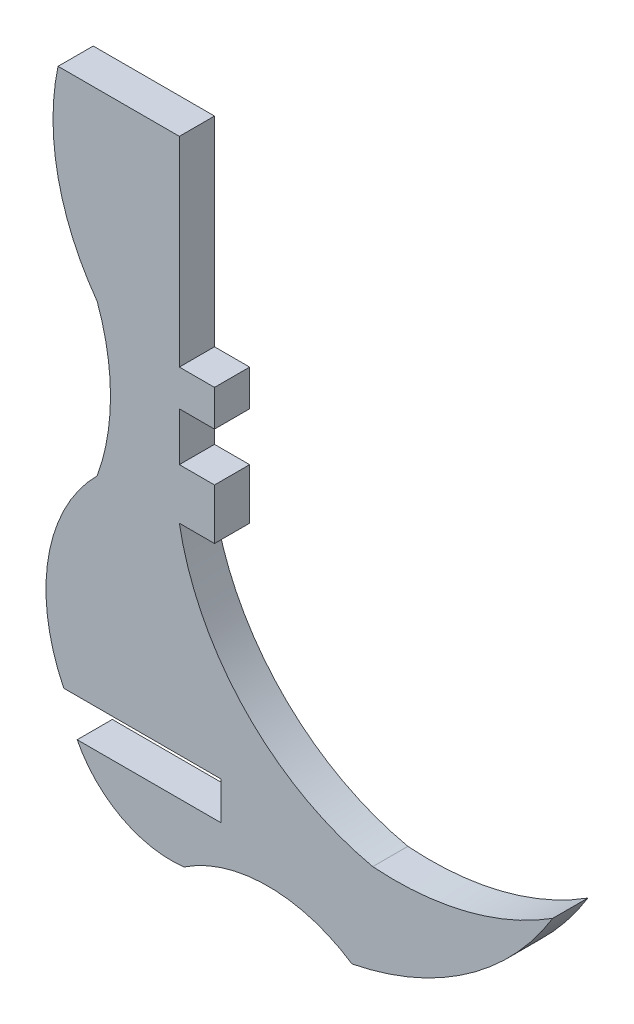
ISO-10303-21;
HEADER;
FILE_DESCRIPTION(('STEP AP214'),'2;1');
FILE_NAME('part.step','',(''),(''),'','','');
FILE_SCHEMA(('AUTOMOTIVE_DESIGN { 1 0 10303 214 1 1 1 1 }'));
ENDSEC;
DATA;
#1=APPLICATION_CONTEXT('core data for automotive mechanical design processes');
#2=APPLICATION_PROTOCOL_DEFINITION('international standard','automotive_design',2000,#1);
#3=PRODUCT_CONTEXT('',#1,'mechanical');
#4=PRODUCT('Part','Part','',(#3));
#5=PRODUCT_RELATED_PRODUCT_CATEGORY('part','',(#4));
#6=PRODUCT_DEFINITION_FORMATION('','',#4);
#7=PRODUCT_DEFINITION_CONTEXT('part definition',#1,'design');
#8=PRODUCT_DEFINITION('design','',#6,#7);
#9=PRODUCT_DEFINITION_SHAPE('','',#8);
#10=(LENGTH_UNIT() NAMED_UNIT(*) SI_UNIT(.MILLI.,.METRE.));
#11=(NAMED_UNIT(*) PLANE_ANGLE_UNIT() SI_UNIT($,.RADIAN.));
#12=(NAMED_UNIT(*) SI_UNIT($,.STERADIAN.) SOLID_ANGLE_UNIT());
#13=UNCERTAINTY_MEASURE_WITH_UNIT(LENGTH_MEASURE(1.E-05),#10,'distance_accuracy_value','');
#14=(GEOMETRIC_REPRESENTATION_CONTEXT(3) GLOBAL_UNCERTAINTY_ASSIGNED_CONTEXT((#13)) GLOBAL_UNIT_ASSIGNED_CONTEXT((#10,
#11,#12)) REPRESENTATION_CONTEXT('',''));
#15=CARTESIAN_POINT('',(0.,0.,0.));
#16=DIRECTION('',(0.,0.,1.));
#17=DIRECTION('',(1.,0.,0.));
#18=AXIS2_PLACEMENT_3D('',#15,#16,#17);
#19=CARTESIAN_POINT('',(0.,-1.96432755596697,1.524));
#20=DIRECTION('',(-1.,0.,0.));
#21=DIRECTION('',(0.,-1.,0.));
#22=AXIS2_PLACEMENT_3D('',#19,#20,#21);
#23=PLANE('',#22);
#24=DIRECTION('',(0.,1.,0.));
#25=VECTOR('',#24,1.);
#26=CARTESIAN_POINT('',(0.,-1.96432755596697,0.));
#27=LINE('',#26,#25);
#28=CARTESIAN_POINT('',(0.,-4.16334006774832,0.));
#29=VERTEX_POINT('',#28);
#30=CARTESIAN_POINT('',(0.,-1.96432755596697,0.));
#31=VERTEX_POINT('',#30);
#32=EDGE_CURVE('E199',#29,#31,#27,.T.);
#33=ORIENTED_EDGE('',*,*,#32,.T.);
#34=DIRECTION('',(0.,0.,-1.));
#35=VECTOR('',#34,1.);
#36=CARTESIAN_POINT('',(0.,-1.96432755596697,1.524));
#37=LINE('',#36,#35);
#38=CARTESIAN_POINT('',(0.,-1.96432755596697,1.524));
#39=VERTEX_POINT('',#38);
#40=EDGE_CURVE('E11',#39,#31,#37,.T.);
#41=ORIENTED_EDGE('',*,*,#40,.F.);
#42=DIRECTION('',(0.,1.,0.));
#43=VECTOR('',#42,1.);
#44=CARTESIAN_POINT('',(0.,-1.96432755596697,1.524));
#45=LINE('',#44,#43);
#46=CARTESIAN_POINT('',(0.,-4.16334006774832,1.524));
#47=VERTEX_POINT('',#46);
#48=EDGE_CURVE('E238',#47,#39,#45,.T.);
#49=ORIENTED_EDGE('',*,*,#48,.F.);
#50=DIRECTION('',(0.,0.,-1.));
#51=VECTOR('',#50,1.);
#52=CARTESIAN_POINT('',(0.,-4.16334006774832,1.524));
#53=LINE('',#52,#51);
#54=EDGE_CURVE('E195',#47,#29,#53,.T.);
#55=ORIENTED_EDGE('',*,*,#54,.T.);
#56=EDGE_LOOP('',(#33,#41,#49,#55));
#57=FACE_BOUND('',#56,.T.);
#58=ADVANCED_FACE('F31',(#57),#23,.F.);
#59=CARTESIAN_POINT('',(0.,-1.96432755596697,1.524));
#60=DIRECTION('',(0.,-1.,0.));
#61=DIRECTION('',(0.,0.,-1.));
#62=AXIS2_PLACEMENT_3D('',#59,#60,#61);
#63=PLANE('',#62);
#64=DIRECTION('',(-1.,0.,0.));
#65=VECTOR('',#64,1.);
#66=CARTESIAN_POINT('',(0.,-1.96432755596697,0.));
#67=LINE('',#66,#65);
#68=CARTESIAN_POINT('',(-1.524,-1.96432755596697,0.));
#69=VERTEX_POINT('',#68);
#70=EDGE_CURVE('E202',#31,#69,#67,.T.);
#71=ORIENTED_EDGE('',*,*,#70,.T.);
#72=DIRECTION('',(0.,0.,-1.));
#73=VECTOR('',#72,1.);
#74=CARTESIAN_POINT('',(-1.524,-1.96432755596697,1.524));
#75=LINE('',#74,#73);
#76=CARTESIAN_POINT('',(-1.524,-1.96432755596697,1.524));
#77=VERTEX_POINT('',#76);
#78=EDGE_CURVE('E39',#77,#69,#75,.T.);
#79=ORIENTED_EDGE('',*,*,#78,.F.);
#80=DIRECTION('',(-1.,0.,0.));
#81=VECTOR('',#80,1.);
#82=CARTESIAN_POINT('',(0.,-1.96432755596697,1.524));
#83=LINE('',#82,#81);
#84=EDGE_CURVE('E126',#39,#77,#83,.T.);
#85=ORIENTED_EDGE('',*,*,#84,.F.);
#86=ORIENTED_EDGE('',*,*,#40,.T.);
#87=EDGE_LOOP('',(#71,#79,#85,#86));
#88=FACE_BOUND('',#87,.T.);
#89=ADVANCED_FACE('F356',(#88),#63,.F.);
#90=CARTESIAN_POINT('',(-1.524,-1.96432755596697,1.524));
#91=DIRECTION('',(-1.,0.,0.));
#92=DIRECTION('',(0.,0.,1.));
#93=AXIS2_PLACEMENT_3D('',#90,#91,#92);
#94=PLANE('',#93);
#95=DIRECTION('',(0.,1.,0.));
#96=VECTOR('',#95,1.);
#97=CARTESIAN_POINT('',(-1.524,-1.96432755596697,0.));
#98=LINE('',#97,#96);
#99=CARTESIAN_POINT('',(-1.524,0.132092651268706,0.));
#100=VERTEX_POINT('',#99);
#101=EDGE_CURVE('E204',#69,#100,#98,.T.);
#102=ORIENTED_EDGE('',*,*,#101,.T.);
#103=DIRECTION('',(0.,0.,-1.));
#104=VECTOR('',#103,1.);
#105=CARTESIAN_POINT('',(-1.524,0.132092651268706,1.524));
#106=LINE('',#105,#104);
#107=CARTESIAN_POINT('',(-1.524,0.132092651268706,1.524));
#108=VERTEX_POINT('',#107);
#109=EDGE_CURVE('E281',#108,#100,#106,.T.);
#110=ORIENTED_EDGE('',*,*,#109,.F.);
#111=DIRECTION('',(0.,1.,0.));
#112=VECTOR('',#111,1.);
#113=CARTESIAN_POINT('',(-1.524,-1.96432755596697,1.524));
#114=LINE('',#113,#112);
#115=EDGE_CURVE('E289',#77,#108,#114,.T.);
#116=ORIENTED_EDGE('',*,*,#115,.F.);
#117=ORIENTED_EDGE('',*,*,#78,.T.);
#118=EDGE_LOOP('',(#102,#110,#116,#117));
#119=FACE_BOUND('',#118,.T.);
#120=ADVANCED_FACE('F287',(#119),#94,.F.);
#121=CARTESIAN_POINT('',(-1.524,0.132092651268706,1.524));
#122=DIRECTION('',(0.,1.,0.));
#123=DIRECTION('',(-1.,0.,0.));
#124=AXIS2_PLACEMENT_3D('',#121,#122,#123);
#125=PLANE('',#124);
#126=DIRECTION('',(1.,0.,0.));
#127=VECTOR('',#126,1.);
#128=CARTESIAN_POINT('',(-1.524,0.132092651268706,0.));
#129=LINE('',#128,#127);
#130=CARTESIAN_POINT('',(0.,0.13209265126871,0.));
#131=VERTEX_POINT('',#130);
#132=EDGE_CURVE('E206',#100,#131,#129,.T.);
#133=ORIENTED_EDGE('',*,*,#132,.T.);
#134=DIRECTION('',(0.,0.,-1.));
#135=VECTOR('',#134,1.);
#136=CARTESIAN_POINT('',(0.,0.13209265126871,1.524));
#137=LINE('',#136,#135);
#138=CARTESIAN_POINT('',(0.,0.13209265126871,1.524));
#139=VERTEX_POINT('',#138);
#140=EDGE_CURVE('E278',#139,#131,#137,.T.);
#141=ORIENTED_EDGE('',*,*,#140,.F.);
#142=DIRECTION('',(1.,0.,0.));
#143=VECTOR('',#142,1.);
#144=CARTESIAN_POINT('',(-1.524,0.132092651268706,1.524));
#145=LINE('',#144,#143);
#146=EDGE_CURVE('E307',#108,#139,#145,.T.);
#147=ORIENTED_EDGE('',*,*,#146,.F.);
#148=ORIENTED_EDGE('',*,*,#109,.T.);
#149=EDGE_LOOP('',(#133,#141,#147,#148));
#150=FACE_BOUND('',#149,.T.);
#151=ADVANCED_FACE('F298',(#150),#125,.F.);
#152=CARTESIAN_POINT('',(0.,0.13209265126871,1.524));
#153=DIRECTION('',(-1.,0.,0.));
#154=DIRECTION('',(0.,-1.,0.));
#155=AXIS2_PLACEMENT_3D('',#152,#153,#154);
#156=PLANE('',#155);
#157=DIRECTION('',(0.,1.,0.));
#158=VECTOR('',#157,1.);
#159=CARTESIAN_POINT('',(0.,0.13209265126871,0.));
#160=LINE('',#159,#158);
#161=CARTESIAN_POINT('',(0.,1.69973559423405,0.));
#162=VERTEX_POINT('',#161);
#163=EDGE_CURVE('E208',#131,#162,#160,.T.);
#164=ORIENTED_EDGE('',*,*,#163,.T.);
#165=DIRECTION('',(0.,0.,-1.));
#166=VECTOR('',#165,1.);
#167=CARTESIAN_POINT('',(0.,1.69973559423405,1.524));
#168=LINE('',#167,#166);
#169=CARTESIAN_POINT('',(0.,1.69973559423405,1.524));
#170=VERTEX_POINT('',#169);
#171=EDGE_CURVE('E275',#170,#162,#168,.T.);
#172=ORIENTED_EDGE('',*,*,#171,.F.);
#173=DIRECTION('',(0.,1.,0.));
#174=VECTOR('',#173,1.);
#175=CARTESIAN_POINT('',(0.,0.13209265126871,1.524));
#176=LINE('',#175,#174);
#177=EDGE_CURVE('E304',#139,#170,#176,.T.);
#178=ORIENTED_EDGE('',*,*,#177,.F.);
#179=ORIENTED_EDGE('',*,*,#140,.T.);
#180=EDGE_LOOP('',(#164,#172,#178,#179));
#181=FACE_BOUND('',#180,.T.);
#182=ADVANCED_FACE('F302',(#181),#156,.F.);
#183=CARTESIAN_POINT('',(0.,1.69973559423405,1.524));
#184=DIRECTION('',(0.,-1.,0.));
#185=DIRECTION('',(1.,0.,0.));
#186=AXIS2_PLACEMENT_3D('',#183,#184,#185);
#187=PLANE('',#186);
#188=DIRECTION('',(-1.,0.,0.));
#189=VECTOR('',#188,1.);
#190=CARTESIAN_POINT('',(0.,1.69973559423405,0.));
#191=LINE('',#190,#189);
#192=CARTESIAN_POINT('',(-1.524,1.69973559423406,0.));
#193=VERTEX_POINT('',#192);
#194=EDGE_CURVE('E210',#162,#193,#191,.T.);
#195=ORIENTED_EDGE('',*,*,#194,.T.);
#196=DIRECTION('',(0.,0.,-1.));
#197=VECTOR('',#196,1.);
#198=CARTESIAN_POINT('',(-1.524,1.69973559423406,1.524));
#199=LINE('',#198,#197);
#200=CARTESIAN_POINT('',(-1.524,1.69973559423406,1.524));
#201=VERTEX_POINT('',#200);
#202=EDGE_CURVE('E272',#201,#193,#199,.T.);
#203=ORIENTED_EDGE('',*,*,#202,.F.);
#204=DIRECTION('',(-1.,0.,0.));
#205=VECTOR('',#204,1.);
#206=CARTESIAN_POINT('',(0.,1.69973559423405,1.524));
#207=LINE('',#206,#205);
#208=EDGE_CURVE('E306',#170,#201,#207,.T.);
#209=ORIENTED_EDGE('',*,*,#208,.F.);
#210=ORIENTED_EDGE('',*,*,#171,.T.);
#211=EDGE_LOOP('',(#195,#203,#209,#210));
#212=FACE_BOUND('',#211,.T.);
#213=ADVANCED_FACE('F369',(#212),#187,.F.);
#214=CARTESIAN_POINT('',(-1.524,7.3083705500494,1.524));
#215=DIRECTION('',(-1.,0.,0.));
#216=DIRECTION('',(0.,0.,1.));
#217=AXIS2_PLACEMENT_3D('',#214,#215,#216);
#218=PLANE('',#217);
#219=DIRECTION('',(0.,1.,0.));
#220=VECTOR('',#219,1.);
#221=CARTESIAN_POINT('',(-1.524,7.3083705500494,0.));
#222=LINE('',#221,#220);
#223=CARTESIAN_POINT('',(-1.524,10.3651241783993,0.));
#224=VERTEX_POINT('',#223);
#225=EDGE_CURVE('E213',#193,#224,#222,.T.);
#226=ORIENTED_EDGE('',*,*,#225,.T.);
#227=DIRECTION('',(0.,0.,-1.));
#228=VECTOR('',#227,1.);
#229=CARTESIAN_POINT('',(-1.524,10.3651241783993,1.524));
#230=LINE('',#229,#228);
#231=CARTESIAN_POINT('',(-1.524,10.3651241783993,1.524));
#232=VERTEX_POINT('',#231);
#233=EDGE_CURVE('E269',#232,#224,#230,.T.);
#234=ORIENTED_EDGE('',*,*,#233,.F.);
#235=DIRECTION('',(0.,1.,0.));
#236=VECTOR('',#235,1.);
#237=CARTESIAN_POINT('',(-1.524,1.69973559423406,1.524));
#238=LINE('',#237,#236);
#239=EDGE_CURVE('E309',#201,#232,#238,.T.);
#240=ORIENTED_EDGE('',*,*,#239,.F.);
#241=ORIENTED_EDGE('',*,*,#202,.T.);
#242=EDGE_LOOP('',(#226,#234,#240,#241));
#243=FACE_BOUND('',#242,.T.);
#244=ADVANCED_FACE('F372',(#243),#218,.F.);
#245=CARTESIAN_POINT('',(-1.524,10.3651241783993,1.524));
#246=DIRECTION('',(0.,-1.,0.));
#247=DIRECTION('',(0.,0.,-1.));
#248=AXIS2_PLACEMENT_3D('',#245,#246,#247);
#249=PLANE('',#248);
#250=DIRECTION('',(-1.,0.,0.));
#251=VECTOR('',#250,1.);
#252=CARTESIAN_POINT('',(-1.524,10.3651241783993,0.));
#253=LINE('',#252,#251);
#254=CARTESIAN_POINT('',(-6.78287870292138,10.3651241783993,0.));
#255=VERTEX_POINT('',#254);
#256=EDGE_CURVE('E215',#224,#255,#253,.T.);
#257=ORIENTED_EDGE('',*,*,#256,.T.);
#258=DIRECTION('',(0.,0.,-1.));
#259=VECTOR('',#258,1.);
#260=CARTESIAN_POINT('',(-6.78287870292138,10.3651241783993,1.524));
#261=LINE('',#260,#259);
#262=CARTESIAN_POINT('',(-6.78287870292138,10.3651241783993,1.524));
#263=VERTEX_POINT('',#262);
#264=EDGE_CURVE('E266',#263,#255,#261,.T.);
#265=ORIENTED_EDGE('',*,*,#264,.F.);
#266=DIRECTION('',(-1.,0.,0.));
#267=VECTOR('',#266,1.);
#268=CARTESIAN_POINT('',(-1.524,10.3651241783993,1.524));
#269=LINE('',#268,#267);
#270=EDGE_CURVE('E315',#232,#263,#269,.T.);
#271=ORIENTED_EDGE('',*,*,#270,.F.);
#272=ORIENTED_EDGE('',*,*,#233,.T.);
#273=EDGE_LOOP('',(#257,#265,#271,#272));
#274=FACE_BOUND('',#273,.T.);
#275=ADVANCED_FACE('F376',(#274),#249,.F.);
#276=CARTESIAN_POINT('',(3.02625564825397,8.27912893955156,1.524));
#277=DIRECTION('',(0.,0.,-1.));
#278=DIRECTION('',(-1.,0.,0.));
#279=AXIS2_PLACEMENT_3D('',#276,#277,#278);
#280=CYLINDRICAL_SURFACE('',#279,10.0284840756669);
#281=CARTESIAN_POINT('',(3.02625564825397,8.27912893955156,0.));
#282=DIRECTION('',(0.,0.,1.));
#283=DIRECTION('',(1.,0.,0.));
#284=AXIS2_PLACEMENT_3D('',#281,#282,#283);
#285=CIRCLE('',#284,10.0284840756669);
#286=CARTESIAN_POINT('',(-5.08657769088927,2.38400993590204,0.));
#287=VERTEX_POINT('',#286);
#288=EDGE_CURVE('E217',#255,#287,#285,.T.);
#289=ORIENTED_EDGE('',*,*,#288,.T.);
#290=DIRECTION('',(0.,0.,-1.));
#291=VECTOR('',#290,1.);
#292=CARTESIAN_POINT('',(-5.08657769088927,2.38400993590204,1.524));
#293=LINE('',#292,#291);
#294=CARTESIAN_POINT('',(-5.08657769088927,2.38400993590204,1.524));
#295=VERTEX_POINT('',#294);
#296=EDGE_CURVE('E263',#295,#287,#293,.T.);
#297=ORIENTED_EDGE('',*,*,#296,.F.);
#298=CARTESIAN_POINT('',(3.02625564825397,8.27912893955156,1.524));
#299=DIRECTION('',(0.,0.,1.));
#300=DIRECTION('',(1.,0.,0.));
#301=AXIS2_PLACEMENT_3D('',#298,#299,#300);
#302=CIRCLE('',#301,10.0284840756669);
#303=EDGE_CURVE('E317',#263,#295,#302,.T.);
#304=ORIENTED_EDGE('',*,*,#303,.F.);
#305=ORIENTED_EDGE('',*,*,#264,.T.);
#306=EDGE_LOOP('',(#289,#297,#304,#305));
#307=FACE_BOUND('',#306,.T.);
#308=ADVANCED_FACE('F380',(#307),#280,.T.);
#309=CARTESIAN_POINT('',(-14.0881143212704,-0.88966506592314,1.524));
#310=DIRECTION('',(0.,0.,-1.));
#311=DIRECTION('',(-1.,0.,0.));
#312=AXIS2_PLACEMENT_3D('',#309,#310,#311);
#313=CYLINDRICAL_SURFACE('',#312,9.57834065617156);
#314=CARTESIAN_POINT('',(-14.0881143212704,-0.88966506592314,0.));
#315=DIRECTION('',(0.,0.,-1.));
#316=DIRECTION('',(-1.,0.,0.));
#317=AXIS2_PLACEMENT_3D('',#314,#315,#316);
#318=CIRCLE('',#317,9.57834065617156);
#319=CARTESIAN_POINT('',(-5.08657769088927,-4.16334006774832,0.));
#320=VERTEX_POINT('',#319);
#321=EDGE_CURVE('E219',#287,#320,#318,.T.);
#322=ORIENTED_EDGE('',*,*,#321,.T.);
#323=DIRECTION('',(0.,0.,-1.));
#324=VECTOR('',#323,1.);
#325=CARTESIAN_POINT('',(-5.08657769088927,-4.16334006774832,1.524));
#326=LINE('',#325,#324);
#327=CARTESIAN_POINT('',(-5.08657769088927,-4.16334006774832,1.524));
#328=VERTEX_POINT('',#327);
#329=EDGE_CURVE('E260',#328,#320,#326,.T.);
#330=ORIENTED_EDGE('',*,*,#329,.F.);
#331=CARTESIAN_POINT('',(-14.0881143212704,-0.88966506592314,1.524));
#332=DIRECTION('',(0.,0.,-1.));
#333=DIRECTION('',(-1.,0.,0.));
#334=AXIS2_PLACEMENT_3D('',#331,#332,#333);
#335=CIRCLE('',#334,9.57834065617156);
#336=EDGE_CURVE('E319',#295,#328,#335,.T.);
#337=ORIENTED_EDGE('',*,*,#336,.F.);
#338=ORIENTED_EDGE('',*,*,#296,.T.);
#339=EDGE_LOOP('',(#322,#330,#337,#338));
#340=FACE_BOUND('',#339,.T.);
#341=ADVANCED_FACE('F384',(#340),#313,.F.);
#342=CARTESIAN_POINT('',(0.285426681727199,-9.53051407767388,1.524));
#343=DIRECTION('',(0.,0.,-1.));
#344=DIRECTION('',(-1.,0.,0.));
#345=AXIS2_PLACEMENT_3D('',#342,#343,#344);
#346=CYLINDRICAL_SURFACE('',#345,7.59374662681281);
#347=CARTESIAN_POINT('',(0.285426681727199,-9.53051407767388,0.));
#348=DIRECTION('',(0.,0.,1.));
#349=DIRECTION('',(1.,0.,0.));
#350=AXIS2_PLACEMENT_3D('',#347,#348,#349);
#351=CIRCLE('',#350,7.59374662681281);
#352=CARTESIAN_POINT('',(-6.53629698280156,-12.8665407677708,0.));
#353=VERTEX_POINT('',#352);
#354=EDGE_CURVE('E221',#320,#353,#351,.T.);
#355=ORIENTED_EDGE('',*,*,#354,.T.);
#356=DIRECTION('',(0.,0.,-1.));
#357=VECTOR('',#356,1.);
#358=CARTESIAN_POINT('',(-6.53629698280156,-12.8665407677708,1.524));
#359=LINE('',#358,#357);
#360=CARTESIAN_POINT('',(-6.53629698280156,-12.8665407677708,1.524));
#361=VERTEX_POINT('',#360);
#362=EDGE_CURVE('E257',#361,#353,#359,.T.);
#363=ORIENTED_EDGE('',*,*,#362,.F.);
#364=CARTESIAN_POINT('',(0.285426681727199,-9.53051407767388,1.524));
#365=DIRECTION('',(0.,0.,1.));
#366=DIRECTION('',(1.,0.,0.));
#367=AXIS2_PLACEMENT_3D('',#364,#365,#366);
#368=CIRCLE('',#367,7.59374662681281);
#369=EDGE_CURVE('E321',#328,#361,#368,.T.);
#370=ORIENTED_EDGE('',*,*,#369,.F.);
#371=ORIENTED_EDGE('',*,*,#329,.T.);
#372=EDGE_LOOP('',(#355,#363,#370,#371));
#373=FACE_BOUND('',#372,.T.);
#374=ADVANCED_FACE('F388',(#373),#346,.T.);
#375=CARTESIAN_POINT('',(-6.53629698280156,-12.8665407677708,1.524));
#376=DIRECTION('',(0.,1.,0.));
#377=DIRECTION('',(0.,0.,1.));
#378=AXIS2_PLACEMENT_3D('',#375,#376,#377);
#379=PLANE('',#378);
#380=DIRECTION('',(1.,0.,0.));
#381=VECTOR('',#380,1.);
#382=CARTESIAN_POINT('',(-6.53629698280156,-12.8665407677708,0.));
#383=LINE('',#382,#381);
#384=CARTESIAN_POINT('',(0.285426681727199,-12.8665407677708,0.));
#385=VERTEX_POINT('',#384);
#386=EDGE_CURVE('E223',#353,#385,#383,.T.);
#387=ORIENTED_EDGE('',*,*,#386,.T.);
#388=DIRECTION('',(0.,0.,-1.));
#389=VECTOR('',#388,1.);
#390=CARTESIAN_POINT('',(0.285426681727199,-12.8665407677708,1.524));
#391=LINE('',#390,#389);
#392=CARTESIAN_POINT('',(0.285426681727199,-12.8665407677708,1.524));
#393=VERTEX_POINT('',#392);
#394=EDGE_CURVE('E254',#393,#385,#391,.T.);
#395=ORIENTED_EDGE('',*,*,#394,.F.);
#396=DIRECTION('',(1.,0.,0.));
#397=VECTOR('',#396,1.);
#398=CARTESIAN_POINT('',(-6.53629698280156,-12.8665407677708,1.524));
#399=LINE('',#398,#397);
#400=EDGE_CURVE('E323',#361,#393,#399,.T.);
#401=ORIENTED_EDGE('',*,*,#400,.F.);
#402=ORIENTED_EDGE('',*,*,#362,.T.);
#403=EDGE_LOOP('',(#387,#395,#401,#402));
#404=FACE_BOUND('',#403,.T.);
#405=ADVANCED_FACE('F392',(#404),#379,.F.);
#406=CARTESIAN_POINT('',(0.285426681727199,-12.8665407677708,1.524));
#407=DIRECTION('',(1.,0.,0.));
#408=DIRECTION('',(0.,0.,-1.));
#409=AXIS2_PLACEMENT_3D('',#406,#407,#408);
#410=PLANE('',#409);
#411=DIRECTION('',(0.,-1.,0.));
#412=VECTOR('',#411,1.);
#413=CARTESIAN_POINT('',(0.285426681727199,-12.8665407677708,0.));
#414=LINE('',#413,#412);
#415=CARTESIAN_POINT('',(0.285426681727199,-14.5088427331679,0.));
#416=VERTEX_POINT('',#415);
#417=EDGE_CURVE('E225',#385,#416,#414,.T.);
#418=ORIENTED_EDGE('',*,*,#417,.T.);
#419=DIRECTION('',(0.,0.,-1.));
#420=VECTOR('',#419,1.);
#421=CARTESIAN_POINT('',(0.285426681727199,-14.5088427331679,1.524));
#422=LINE('',#421,#420);
#423=CARTESIAN_POINT('',(0.285426681727199,-14.5088427331679,1.524));
#424=VERTEX_POINT('',#423);
#425=EDGE_CURVE('E251',#424,#416,#422,.T.);
#426=ORIENTED_EDGE('',*,*,#425,.F.);
#427=DIRECTION('',(0.,-1.,0.));
#428=VECTOR('',#427,1.);
#429=CARTESIAN_POINT('',(0.285426681727199,-12.8665407677708,1.524));
#430=LINE('',#429,#428);
#431=EDGE_CURVE('E325',#393,#424,#430,.T.);
#432=ORIENTED_EDGE('',*,*,#431,.F.);
#433=ORIENTED_EDGE('',*,*,#394,.T.);
#434=EDGE_LOOP('',(#418,#426,#432,#433));
#435=FACE_BOUND('',#434,.T.);
#436=ADVANCED_FACE('F396',(#435),#410,.F.);
#437=CARTESIAN_POINT('',(0.285426681727199,-14.5088427331679,1.524));
#438=DIRECTION('',(0.,-1.,0.));
#439=DIRECTION('',(0.,0.,-1.));
#440=AXIS2_PLACEMENT_3D('',#437,#438,#439);
#441=PLANE('',#440);
#442=DIRECTION('',(-1.,0.,0.));
#443=VECTOR('',#442,1.);
#444=CARTESIAN_POINT('',(0.285426681727199,-14.5088427331679,0.));
#445=LINE('',#444,#443);
#446=CARTESIAN_POINT('',(-5.95497870887129,-14.5088427331679,0.));
#447=VERTEX_POINT('',#446);
#448=EDGE_CURVE('E227',#416,#447,#445,.T.);
#449=ORIENTED_EDGE('',*,*,#448,.T.);
#450=DIRECTION('',(0.,0.,-1.));
#451=VECTOR('',#450,1.);
#452=CARTESIAN_POINT('',(-5.95497870887129,-14.5088427331679,1.524));
#453=LINE('',#452,#451);
#454=CARTESIAN_POINT('',(-5.95497870887129,-14.5088427331679,1.524));
#455=VERTEX_POINT('',#454);
#456=EDGE_CURVE('E248',#455,#447,#453,.T.);
#457=ORIENTED_EDGE('',*,*,#456,.F.);
#458=DIRECTION('',(-1.,0.,0.));
#459=VECTOR('',#458,1.);
#460=CARTESIAN_POINT('',(0.285426681727199,-14.5088427331679,1.524));
#461=LINE('',#460,#459);
#462=EDGE_CURVE('E327',#424,#455,#461,.T.);
#463=ORIENTED_EDGE('',*,*,#462,.F.);
#464=ORIENTED_EDGE('',*,*,#425,.T.);
#465=EDGE_LOOP('',(#449,#457,#463,#464));
#466=FACE_BOUND('',#465,.T.);
#467=ADVANCED_FACE('F400',(#466),#441,.F.);
#468=CARTESIAN_POINT('',(-1.88454656108071,-12.4398477599038,1.524));
#469=DIRECTION('',(0.,0.,-1.));
#470=DIRECTION('',(-1.,0.,0.));
#471=AXIS2_PLACEMENT_3D('',#468,#469,#470);
#472=CYLINDRICAL_SURFACE('',#471,4.56608782976839);
#473=CARTESIAN_POINT('',(-1.88454656108071,-12.4398477599038,0.));
#474=DIRECTION('',(0.,0.,1.));
#475=DIRECTION('',(1.,0.,0.));
#476=AXIS2_PLACEMENT_3D('',#473,#474,#475);
#477=CIRCLE('',#476,4.56608782976839);
#478=CARTESIAN_POINT('',(-1.32175238300647,-16.9711191910018,0.));
#479=VERTEX_POINT('',#478);
#480=EDGE_CURVE('E229',#447,#479,#477,.T.);
#481=ORIENTED_EDGE('',*,*,#480,.T.);
#482=DIRECTION('',(0.,0.,-1.));
#483=VECTOR('',#482,1.);
#484=CARTESIAN_POINT('',(-1.32175238300647,-16.9711191910018,1.524));
#485=LINE('',#484,#483);
#486=CARTESIAN_POINT('',(-1.32175238300647,-16.9711191910018,1.524));
#487=VERTEX_POINT('',#486);
#488=EDGE_CURVE('E245',#487,#479,#485,.T.);
#489=ORIENTED_EDGE('',*,*,#488,.F.);
#490=CARTESIAN_POINT('',(-1.88454656108071,-12.4398477599038,1.524));
#491=DIRECTION('',(0.,0.,1.));
#492=DIRECTION('',(1.,0.,0.));
#493=AXIS2_PLACEMENT_3D('',#490,#491,#492);
#494=CIRCLE('',#493,4.56608782976839);
#495=EDGE_CURVE('E329',#455,#487,#494,.T.);
#496=ORIENTED_EDGE('',*,*,#495,.F.);
#497=ORIENTED_EDGE('',*,*,#456,.T.);
#498=EDGE_LOOP('',(#481,#489,#496,#497));
#499=FACE_BOUND('',#498,.T.);
#500=ADVANCED_FACE('F404',(#499),#472,.T.);
#501=CARTESIAN_POINT('',(2.31911895711789,-22.4356498697834,1.524));
#502=DIRECTION('',(0.,0.,-1.));
#503=DIRECTION('',(-1.,0.,0.));
#504=AXIS2_PLACEMENT_3D('',#501,#502,#503);
#505=CYLINDRICAL_SURFACE('',#504,6.56635664997601);
#506=CARTESIAN_POINT('',(2.31911895711789,-22.4356498697834,0.));
#507=DIRECTION('',(0.,0.,-1.));
#508=DIRECTION('',(-1.,0.,0.));
#509=AXIS2_PLACEMENT_3D('',#506,#507,#508);
#510=CIRCLE('',#509,6.56635664997601);
#511=CARTESIAN_POINT('',(5.95999029724226,-16.9711191910018,0.));
#512=VERTEX_POINT('',#511);
#513=EDGE_CURVE('E231',#479,#512,#510,.T.);
#514=ORIENTED_EDGE('',*,*,#513,.T.);
#515=DIRECTION('',(0.,0.,-1.));
#516=VECTOR('',#515,1.);
#517=CARTESIAN_POINT('',(5.95999029724226,-16.9711191910018,1.524));
#518=LINE('',#517,#516);
#519=CARTESIAN_POINT('',(5.95999029724226,-16.9711191910018,1.524));
#520=VERTEX_POINT('',#519);
#521=EDGE_CURVE('E242',#520,#512,#518,.T.);
#522=ORIENTED_EDGE('',*,*,#521,.F.);
#523=CARTESIAN_POINT('',(2.31911895711789,-22.4356498697834,1.524));
#524=DIRECTION('',(0.,0.,-1.));
#525=DIRECTION('',(-1.,0.,0.));
#526=AXIS2_PLACEMENT_3D('',#523,#524,#525);
#527=CIRCLE('',#526,6.56635664997601);
#528=EDGE_CURVE('E331',#487,#520,#527,.T.);
#529=ORIENTED_EDGE('',*,*,#528,.F.);
#530=ORIENTED_EDGE('',*,*,#488,.T.);
#531=EDGE_LOOP('',(#514,#522,#529,#530));
#532=FACE_BOUND('',#531,.T.);
#533=ADVANCED_FACE('F337',(#532),#505,.F.);
#534=CARTESIAN_POINT('',(3.40325966182314,-4.02014149822186,1.524));
#535=DIRECTION('',(0.,0.,-1.));
#536=DIRECTION('',(-1.,0.,0.));
#537=AXIS2_PLACEMENT_3D('',#534,#535,#536);
#538=CYLINDRICAL_SURFACE('',#537,13.200935373714);
#539=CARTESIAN_POINT('',(3.40325966182314,-4.02014149822186,0.));
#540=DIRECTION('',(0.,0.,1.));
#541=DIRECTION('',(1.,0.,0.));
#542=AXIS2_PLACEMENT_3D('',#539,#540,#541);
#543=CIRCLE('',#542,13.200935373714);
#544=CARTESIAN_POINT('',(14.666489014644,-10.9052238714931,0.));
#545=VERTEX_POINT('',#544);
#546=EDGE_CURVE('E233',#512,#545,#543,.T.);
#547=ORIENTED_EDGE('',*,*,#546,.T.);
#548=DIRECTION('',(0.,0.,-1.));
#549=VECTOR('',#548,1.);
#550=CARTESIAN_POINT('',(14.666489014644,-10.9052238714931,1.524));
#551=LINE('',#550,#549);
#552=CARTESIAN_POINT('',(14.666489014644,-10.9052238714931,1.524));
#553=VERTEX_POINT('',#552);
#554=EDGE_CURVE('E190',#553,#545,#551,.T.);
#555=ORIENTED_EDGE('',*,*,#554,.F.);
#556=CARTESIAN_POINT('',(3.40325966182314,-4.02014149822186,1.524));
#557=DIRECTION('',(0.,0.,1.));
#558=DIRECTION('',(1.,0.,0.));
#559=AXIS2_PLACEMENT_3D('',#556,#557,#558);
#560=CIRCLE('',#559,13.200935373714);
#561=EDGE_CURVE('E181',#520,#553,#560,.T.);
#562=ORIENTED_EDGE('',*,*,#561,.F.);
#563=ORIENTED_EDGE('',*,*,#521,.T.);
#564=EDGE_LOOP('',(#547,#555,#562,#563));
#565=FACE_BOUND('',#564,.T.);
#566=ADVANCED_FACE('F341',(#565),#538,.T.);
#567=CARTESIAN_POINT('',(7.82072102706119,-0.173463673114431,1.524));
#568=DIRECTION('',(0.,0.,-1.));
#569=DIRECTION('',(-1.,0.,0.));
#570=AXIS2_PLACEMENT_3D('',#567,#568,#569);
#571=CYLINDRICAL_SURFACE('',#570,12.729305412917);
#572=CARTESIAN_POINT('',(7.82072102706119,-0.173463673114431,0.));
#573=DIRECTION('',(0.,0.,-1.));
#574=DIRECTION('',(-1.,0.,0.));
#575=AXIS2_PLACEMENT_3D('',#572,#573,#574);
#576=CIRCLE('',#575,12.729305412917);
#577=CARTESIAN_POINT('',(6.86102828225899,-12.8665407677708,0.));
#578=VERTEX_POINT('',#577);
#579=EDGE_CURVE('E189',#545,#578,#576,.T.);
#580=ORIENTED_EDGE('',*,*,#579,.T.);
#581=DIRECTION('',(0.,0.,-1.));
#582=VECTOR('',#581,1.);
#583=CARTESIAN_POINT('',(6.86102828225899,-12.8665407677708,1.524));
#584=LINE('',#583,#582);
#585=CARTESIAN_POINT('',(6.86102828225899,-12.8665407677708,1.524));
#586=VERTEX_POINT('',#585);
#587=EDGE_CURVE('E186',#586,#578,#584,.T.);
#588=ORIENTED_EDGE('',*,*,#587,.F.);
#589=CARTESIAN_POINT('',(7.82072102706119,-0.173463673114431,1.524));
#590=DIRECTION('',(0.,0.,-1.));
#591=DIRECTION('',(-1.,0.,0.));
#592=AXIS2_PLACEMENT_3D('',#589,#590,#591);
#593=CIRCLE('',#592,12.729305412917);
#594=EDGE_CURVE('E175',#553,#586,#593,.T.);
#595=ORIENTED_EDGE('',*,*,#594,.F.);
#596=ORIENTED_EDGE('',*,*,#554,.T.);
#597=EDGE_LOOP('',(#580,#588,#595,#596));
#598=FACE_BOUND('',#597,.T.);
#599=ADVANCED_FACE('F187',(#598),#571,.F.);
#600=CARTESIAN_POINT('',(9.18943508401508,-2.23241190703258,1.524));
#601=DIRECTION('',(0.,0.,-1.));
#602=DIRECTION('',(-1.,0.,0.));
#603=AXIS2_PLACEMENT_3D('',#600,#601,#602);
#604=CYLINDRICAL_SURFACE('',#603,10.8860541456145);
#605=CARTESIAN_POINT('',(9.18943508401508,-2.23241190703258,0.));
#606=DIRECTION('',(0.,0.,-1.));
#607=DIRECTION('',(1.,0.,0.));
#608=AXIS2_PLACEMENT_3D('',#605,#606,#607);
#609=CIRCLE('',#608,10.8860541456145);
#610=CARTESIAN_POINT('',(-1.524,-4.16334006774832,0.));
#611=VERTEX_POINT('',#610);
#612=EDGE_CURVE('E112',#578,#611,#609,.T.);
#613=ORIENTED_EDGE('',*,*,#612,.T.);
#614=DIRECTION('',(0.,0.,-1.));
#615=VECTOR('',#614,1.);
#616=CARTESIAN_POINT('',(-1.524,-4.16334006774832,1.524));
#617=LINE('',#616,#615);
#618=CARTESIAN_POINT('',(-1.524,-4.16334006774832,1.524));
#619=VERTEX_POINT('',#618);
#620=EDGE_CURVE('E191',#619,#611,#617,.T.);
#621=ORIENTED_EDGE('',*,*,#620,.F.);
#622=CARTESIAN_POINT('',(9.18943508401508,-2.23241190703258,1.524));
#623=DIRECTION('',(0.,0.,-1.));
#624=DIRECTION('',(1.,0.,0.));
#625=AXIS2_PLACEMENT_3D('',#622,#623,#624);
#626=CIRCLE('',#625,10.8860541456145);
#627=EDGE_CURVE('E179',#586,#619,#626,.T.);
#628=ORIENTED_EDGE('',*,*,#627,.F.);
#629=ORIENTED_EDGE('',*,*,#587,.T.);
#630=EDGE_LOOP('',(#613,#621,#628,#629));
#631=FACE_BOUND('',#630,.T.);
#632=ADVANCED_FACE('F193',(#631),#604,.F.);
#633=CARTESIAN_POINT('',(0.,-4.16334006774832,1.524));
#634=DIRECTION('',(0.,1.,0.));
#635=DIRECTION('',(0.,0.,1.));
#636=AXIS2_PLACEMENT_3D('',#633,#634,#635);
#637=PLANE('',#636);
#638=DIRECTION('',(1.,0.,0.));
#639=VECTOR('',#638,1.);
#640=CARTESIAN_POINT('',(0.,-4.16334006774832,0.));
#641=LINE('',#640,#639);
#642=EDGE_CURVE('E118',#611,#29,#641,.T.);
#643=ORIENTED_EDGE('',*,*,#642,.T.);
#644=ORIENTED_EDGE('',*,*,#54,.F.);
#645=DIRECTION('',(1.,0.,0.));
#646=VECTOR('',#645,1.);
#647=CARTESIAN_POINT('',(0.,-4.16334006774832,1.524));
#648=LINE('',#647,#646);
#649=EDGE_CURVE('E47',#619,#47,#648,.T.);
#650=ORIENTED_EDGE('',*,*,#649,.F.);
#651=ORIENTED_EDGE('',*,*,#620,.T.);
#652=EDGE_LOOP('',(#643,#644,#650,#651));
#653=FACE_BOUND('',#652,.T.);
#654=ADVANCED_FACE('F345',(#653),#637,.F.);
#655=CARTESIAN_POINT('',(9.18943508401508,-2.23241190703258,1.524));
#656=DIRECTION('',(0.,0.,1.));
#657=DIRECTION('',(1.,0.,0.));
#658=AXIS2_PLACEMENT_3D('',#655,#656,#657);
#659=PLANE('',#658);
#660=ORIENTED_EDGE('',*,*,#48,.T.);
#661=ORIENTED_EDGE('',*,*,#84,.T.);
#662=ORIENTED_EDGE('',*,*,#115,.T.);
#663=ORIENTED_EDGE('',*,*,#146,.T.);
#664=ORIENTED_EDGE('',*,*,#177,.T.);
#665=ORIENTED_EDGE('',*,*,#208,.T.);
#666=ORIENTED_EDGE('',*,*,#239,.T.);
#667=ORIENTED_EDGE('',*,*,#270,.T.);
#668=ORIENTED_EDGE('',*,*,#303,.T.);
#669=ORIENTED_EDGE('',*,*,#336,.T.);
#670=ORIENTED_EDGE('',*,*,#369,.T.);
#671=ORIENTED_EDGE('',*,*,#400,.T.);
#672=ORIENTED_EDGE('',*,*,#431,.T.);
#673=ORIENTED_EDGE('',*,*,#462,.T.);
#674=ORIENTED_EDGE('',*,*,#495,.T.);
#675=ORIENTED_EDGE('',*,*,#528,.T.);
#676=ORIENTED_EDGE('',*,*,#561,.T.);
#677=ORIENTED_EDGE('',*,*,#594,.T.);
#678=ORIENTED_EDGE('',*,*,#627,.T.);
#679=ORIENTED_EDGE('',*,*,#649,.T.);
#680=EDGE_LOOP('',(#660,#661,#662,#663,#664,#665,#666,#667,#668,#669,#670,#671,#672,#673,#674,
#675,#676,#677,#678,#679));
#681=FACE_BOUND('',#680,.T.);
#682=ADVANCED_FACE('F177',(#681),#659,.T.);
#683=CARTESIAN_POINT('',(9.18943508401508,-2.23241190703258,0.));
#684=DIRECTION('',(0.,0.,1.));
#685=DIRECTION('',(1.,0.,0.));
#686=AXIS2_PLACEMENT_3D('',#683,#684,#685);
#687=PLANE('',#686);
#688=ORIENTED_EDGE('',*,*,#32,.F.);
#689=ORIENTED_EDGE('',*,*,#642,.F.);
#690=ORIENTED_EDGE('',*,*,#612,.F.);
#691=ORIENTED_EDGE('',*,*,#579,.F.);
#692=ORIENTED_EDGE('',*,*,#546,.F.);
#693=ORIENTED_EDGE('',*,*,#513,.F.);
#694=ORIENTED_EDGE('',*,*,#480,.F.);
#695=ORIENTED_EDGE('',*,*,#448,.F.);
#696=ORIENTED_EDGE('',*,*,#417,.F.);
#697=ORIENTED_EDGE('',*,*,#386,.F.);
#698=ORIENTED_EDGE('',*,*,#354,.F.);
#699=ORIENTED_EDGE('',*,*,#321,.F.);
#700=ORIENTED_EDGE('',*,*,#288,.F.);
#701=ORIENTED_EDGE('',*,*,#256,.F.);
#702=ORIENTED_EDGE('',*,*,#225,.F.);
#703=ORIENTED_EDGE('',*,*,#194,.F.);
#704=ORIENTED_EDGE('',*,*,#163,.F.);
#705=ORIENTED_EDGE('',*,*,#132,.F.);
#706=ORIENTED_EDGE('',*,*,#101,.F.);
#707=ORIENTED_EDGE('',*,*,#70,.F.);
#708=EDGE_LOOP('',(#688,#689,#690,#691,#692,#693,#694,#695,#696,#697,#698,#699,#700,#701,#702,
#703,#704,#705,#706,#707));
#709=FACE_BOUND('',#708,.T.);
#710=ADVANCED_FACE('F293',(#709),#687,.F.);
#711=CLOSED_SHELL('',(#58,#89,#120,#151,#182,#213,#244,#275,#308,#341,#374,#405,#436,#467,#500,
#533,#566,#599,#632,#654,#682,#710));
#712=MANIFOLD_SOLID_BREP('B2',#711);
#713=ADVANCED_BREP_SHAPE_REPRESENTATION('',(#18,#712),#14);
#714=SHAPE_DEFINITION_REPRESENTATION(#9,#713);
ENDSEC;
END-ISO-10303-21;
